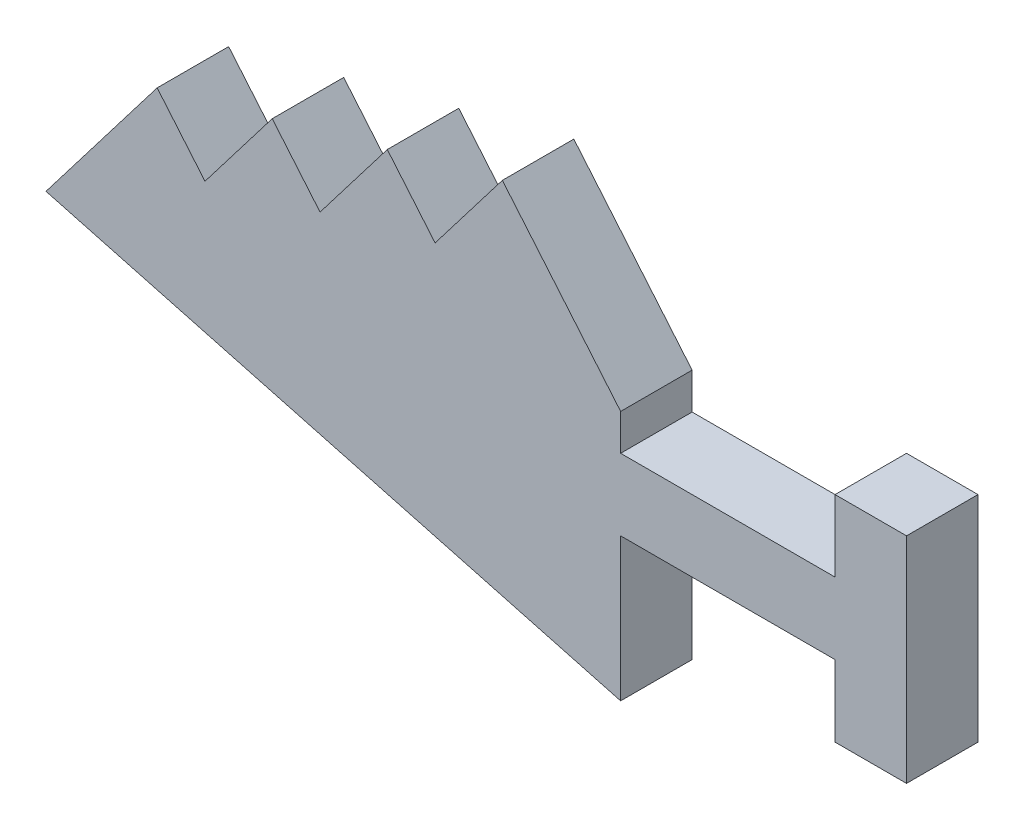
ISO-10303-21;
HEADER;
FILE_DESCRIPTION(('STEP AP214'),'2;1');
FILE_NAME('part.step','',(''),(''),'','','');
FILE_SCHEMA(('AUTOMOTIVE_DESIGN { 1 0 10303 214 1 1 1 1 }'));
ENDSEC;
DATA;
#1=APPLICATION_CONTEXT('core data for automotive mechanical design processes');
#2=APPLICATION_PROTOCOL_DEFINITION('international standard','automotive_design',2000,#1);
#3=PRODUCT_CONTEXT('',#1,'mechanical');
#4=PRODUCT('Part','Part','',(#3));
#5=PRODUCT_RELATED_PRODUCT_CATEGORY('part','',(#4));
#6=PRODUCT_DEFINITION_FORMATION('','',#4);
#7=PRODUCT_DEFINITION_CONTEXT('part definition',#1,'design');
#8=PRODUCT_DEFINITION('design','',#6,#7);
#9=PRODUCT_DEFINITION_SHAPE('','',#8);
#10=(LENGTH_UNIT() NAMED_UNIT(*) SI_UNIT(.MILLI.,.METRE.));
#11=(NAMED_UNIT(*) PLANE_ANGLE_UNIT() SI_UNIT($,.RADIAN.));
#12=(NAMED_UNIT(*) SI_UNIT($,.STERADIAN.) SOLID_ANGLE_UNIT());
#13=UNCERTAINTY_MEASURE_WITH_UNIT(LENGTH_MEASURE(1.E-05),#10,'distance_accuracy_value','');
#14=(GEOMETRIC_REPRESENTATION_CONTEXT(3) GLOBAL_UNCERTAINTY_ASSIGNED_CONTEXT((#13)) GLOBAL_UNIT_ASSIGNED_CONTEXT((#10,
#11,#12)) REPRESENTATION_CONTEXT('',''));
#15=CARTESIAN_POINT('',(0.,0.,0.));
#16=DIRECTION('',(0.,0.,1.));
#17=DIRECTION('',(1.,0.,0.));
#18=AXIS2_PLACEMENT_3D('',#15,#16,#17);
#19=CARTESIAN_POINT('',(66.0319458824785,7.59170549426689,6.));
#20=DIRECTION('',(-0.258819045102532,-0.965925826289065,0.));
#21=DIRECTION('',(0.965925826289065,-0.258819045102532,0.));
#22=AXIS2_PLACEMENT_3D('',#19,#20,#21);
#23=PLANE('',#22);
#24=DIRECTION('',(-0.965925826289065,0.258819045102532,0.));
#25=VECTOR('',#24,1.);
#26=CARTESIAN_POINT('',(66.0319458824785,7.59170549426689,0.));
#27=LINE('',#26,#25);
#28=CARTESIAN_POINT('',(66.0319458824785,7.59170549426689,0.));
#29=VERTEX_POINT('',#28);
#30=CARTESIAN_POINT('',(17.7918774883562,20.5175928632947,0.));
#31=VERTEX_POINT('',#30);
#32=EDGE_CURVE('E198',#29,#31,#27,.T.);
#33=ORIENTED_EDGE('',*,*,#32,.F.);
#34=DIRECTION('',(0.,0.,-1.));
#35=VECTOR('',#34,1.);
#36=CARTESIAN_POINT('',(66.0319458824785,7.59170549426689,6.));
#37=LINE('',#36,#35);
#38=CARTESIAN_POINT('',(66.0319458824785,7.59170549426689,6.));
#39=VERTEX_POINT('',#38);
#40=EDGE_CURVE('E48',#39,#29,#37,.T.);
#41=ORIENTED_EDGE('',*,*,#40,.F.);
#42=DIRECTION('',(-0.965925826289065,0.258819045102532,0.));
#43=VECTOR('',#42,1.);
#44=CARTESIAN_POINT('',(66.0319458824785,7.59170549426689,6.));
#45=LINE('',#44,#43);
#46=CARTESIAN_POINT('',(17.7918774883562,20.5175928632947,6.));
#47=VERTEX_POINT('',#46);
#48=EDGE_CURVE('E320',#39,#47,#45,.T.);
#49=ORIENTED_EDGE('',*,*,#48,.T.);
#50=DIRECTION('',(0.,0.,-1.));
#51=VECTOR('',#50,1.);
#52=CARTESIAN_POINT('',(17.7918774883562,20.5175928632947,6.));
#53=LINE('',#52,#51);
#54=EDGE_CURVE('E11',#47,#31,#53,.T.);
#55=ORIENTED_EDGE('',*,*,#54,.T.);
#56=EDGE_LOOP('',(#33,#41,#49,#55));
#57=FACE_BOUND('',#56,.T.);
#58=ADVANCED_FACE('F39',(#57),#23,.T.);
#59=CARTESIAN_POINT('',(66.0319458824785,7.59170549426689,6.));
#60=DIRECTION('',(-1.,0.,0.));
#61=DIRECTION('',(0.,0.,1.));
#62=AXIS2_PLACEMENT_3D('',#59,#60,#61);
#63=PLANE('',#62);
#64=DIRECTION('',(0.,1.,0.));
#65=VECTOR('',#64,1.);
#66=CARTESIAN_POINT('',(66.0319458824785,7.59170549426689,0.));
#67=LINE('',#66,#65);
#68=CARTESIAN_POINT('',(66.0319458824785,19.5917054942669,0.));
#69=VERTEX_POINT('',#68);
#70=EDGE_CURVE('E202',#29,#69,#67,.T.);
#71=ORIENTED_EDGE('',*,*,#70,.T.);
#72=DIRECTION('',(0.,0.,-1.));
#73=VECTOR('',#72,1.);
#74=CARTESIAN_POINT('',(66.0319458824785,19.5917054942669,6.));
#75=LINE('',#74,#73);
#76=CARTESIAN_POINT('',(66.0319458824785,19.5917054942669,6.));
#77=VERTEX_POINT('',#76);
#78=EDGE_CURVE('E304',#77,#69,#75,.T.);
#79=ORIENTED_EDGE('',*,*,#78,.F.);
#80=DIRECTION('',(0.,1.,0.));
#81=VECTOR('',#80,1.);
#82=CARTESIAN_POINT('',(66.0319458824785,7.59170549426689,6.));
#83=LINE('',#82,#81);
#84=EDGE_CURVE('E313',#39,#77,#83,.T.);
#85=ORIENTED_EDGE('',*,*,#84,.F.);
#86=ORIENTED_EDGE('',*,*,#40,.T.);
#87=EDGE_LOOP('',(#71,#79,#85,#86));
#88=FACE_BOUND('',#87,.T.);
#89=ADVANCED_FACE('F311',(#88),#63,.F.);
#90=CARTESIAN_POINT('',(66.0319458824785,19.5917054942669,6.));
#91=DIRECTION('',(0.,1.,0.));
#92=DIRECTION('',(0.,0.,1.));
#93=AXIS2_PLACEMENT_3D('',#90,#91,#92);
#94=PLANE('',#93);
#95=DIRECTION('',(1.,0.,0.));
#96=VECTOR('',#95,1.);
#97=CARTESIAN_POINT('',(66.0319458824785,19.5917054942669,0.));
#98=LINE('',#97,#96);
#99=CARTESIAN_POINT('',(84.0319458824785,19.5917054942669,0.));
#100=VERTEX_POINT('',#99);
#101=EDGE_CURVE('E205',#69,#100,#98,.T.);
#102=ORIENTED_EDGE('',*,*,#101,.T.);
#103=DIRECTION('',(0.,0.,-1.));
#104=VECTOR('',#103,1.);
#105=CARTESIAN_POINT('',(84.0319458824785,19.5917054942669,6.));
#106=LINE('',#105,#104);
#107=CARTESIAN_POINT('',(84.0319458824785,19.5917054942669,6.));
#108=VERTEX_POINT('',#107);
#109=EDGE_CURVE('E301',#108,#100,#106,.T.);
#110=ORIENTED_EDGE('',*,*,#109,.F.);
#111=DIRECTION('',(1.,0.,0.));
#112=VECTOR('',#111,1.);
#113=CARTESIAN_POINT('',(66.0319458824785,19.5917054942669,6.));
#114=LINE('',#113,#112);
#115=EDGE_CURVE('E547',#77,#108,#114,.T.);
#116=ORIENTED_EDGE('',*,*,#115,.F.);
#117=ORIENTED_EDGE('',*,*,#78,.T.);
#118=EDGE_LOOP('',(#102,#110,#116,#117));
#119=FACE_BOUND('',#118,.T.);
#120=ADVANCED_FACE('F335',(#119),#94,.F.);
#121=CARTESIAN_POINT('',(84.0319458824785,13.5917054942669,6.));
#122=DIRECTION('',(-1.,0.,0.));
#123=DIRECTION('',(0.,0.,1.));
#124=AXIS2_PLACEMENT_3D('',#121,#122,#123);
#125=PLANE('',#124);
#126=DIRECTION('',(0.,1.,0.));
#127=VECTOR('',#126,1.);
#128=CARTESIAN_POINT('',(84.0319458824785,13.5917054942669,0.));
#129=LINE('',#128,#127);
#130=CARTESIAN_POINT('',(84.0319458824785,13.5917054942669,0.));
#131=VERTEX_POINT('',#130);
#132=EDGE_CURVE('E209',#131,#100,#129,.T.);
#133=ORIENTED_EDGE('',*,*,#132,.F.);
#134=DIRECTION('',(0.,0.,-1.));
#135=VECTOR('',#134,1.);
#136=CARTESIAN_POINT('',(84.0319458824785,13.5917054942669,6.));
#137=LINE('',#136,#135);
#138=CARTESIAN_POINT('',(84.0319458824785,13.5917054942669,6.));
#139=VERTEX_POINT('',#138);
#140=EDGE_CURVE('E298',#139,#131,#137,.T.);
#141=ORIENTED_EDGE('',*,*,#140,.F.);
#142=DIRECTION('',(0.,1.,0.));
#143=VECTOR('',#142,1.);
#144=CARTESIAN_POINT('',(84.0319458824785,13.5917054942669,6.));
#145=LINE('',#144,#143);
#146=EDGE_CURVE('E545',#139,#108,#145,.T.);
#147=ORIENTED_EDGE('',*,*,#146,.T.);
#148=ORIENTED_EDGE('',*,*,#109,.T.);
#149=EDGE_LOOP('',(#133,#141,#147,#148));
#150=FACE_BOUND('',#149,.T.);
#151=ADVANCED_FACE('F339',(#150),#125,.T.);
#152=CARTESIAN_POINT('',(90.0319458824785,13.5917054942669,6.));
#153=DIRECTION('',(0.,-1.,0.));
#154=DIRECTION('',(0.,0.,-1.));
#155=AXIS2_PLACEMENT_3D('',#152,#153,#154);
#156=PLANE('',#155);
#157=DIRECTION('',(-1.,0.,0.));
#158=VECTOR('',#157,1.);
#159=CARTESIAN_POINT('',(90.0319458824785,13.5917054942669,0.));
#160=LINE('',#159,#158);
#161=CARTESIAN_POINT('',(90.0319458824785,13.5917054942669,0.));
#162=VERTEX_POINT('',#161);
#163=EDGE_CURVE('E213',#162,#131,#160,.T.);
#164=ORIENTED_EDGE('',*,*,#163,.F.);
#165=DIRECTION('',(0.,0.,-1.));
#166=VECTOR('',#165,1.);
#167=CARTESIAN_POINT('',(90.0319458824785,13.5917054942669,6.));
#168=LINE('',#167,#166);
#169=CARTESIAN_POINT('',(90.0319458824785,13.5917054942669,6.));
#170=VERTEX_POINT('',#169);
#171=EDGE_CURVE('E295',#170,#162,#168,.T.);
#172=ORIENTED_EDGE('',*,*,#171,.F.);
#173=DIRECTION('',(-1.,0.,0.));
#174=VECTOR('',#173,1.);
#175=CARTESIAN_POINT('',(90.0319458824785,13.5917054942669,6.));
#176=LINE('',#175,#174);
#177=EDGE_CURVE('E552',#170,#139,#176,.T.);
#178=ORIENTED_EDGE('',*,*,#177,.T.);
#179=ORIENTED_EDGE('',*,*,#140,.T.);
#180=EDGE_LOOP('',(#164,#172,#178,#179));
#181=FACE_BOUND('',#180,.T.);
#182=ADVANCED_FACE('F345',(#181),#156,.T.);
#183=CARTESIAN_POINT('',(90.0319458824785,31.5917054942669,6.));
#184=DIRECTION('',(1.,0.,0.));
#185=DIRECTION('',(0.,0.,-1.));
#186=AXIS2_PLACEMENT_3D('',#183,#184,#185);
#187=PLANE('',#186);
#188=DIRECTION('',(0.,-1.,0.));
#189=VECTOR('',#188,1.);
#190=CARTESIAN_POINT('',(90.0319458824785,31.5917054942669,0.));
#191=LINE('',#190,#189);
#192=CARTESIAN_POINT('',(90.0319458824785,31.5917054942669,0.));
#193=VERTEX_POINT('',#192);
#194=EDGE_CURVE('E217',#193,#162,#191,.T.);
#195=ORIENTED_EDGE('',*,*,#194,.F.);
#196=DIRECTION('',(0.,0.,-1.));
#197=VECTOR('',#196,1.);
#198=CARTESIAN_POINT('',(90.0319458824785,31.5917054942669,6.));
#199=LINE('',#198,#197);
#200=CARTESIAN_POINT('',(90.0319458824785,31.5917054942669,6.));
#201=VERTEX_POINT('',#200);
#202=EDGE_CURVE('E292',#201,#193,#199,.T.);
#203=ORIENTED_EDGE('',*,*,#202,.F.);
#204=DIRECTION('',(0.,-1.,0.));
#205=VECTOR('',#204,1.);
#206=CARTESIAN_POINT('',(90.0319458824785,31.5917054942669,6.));
#207=LINE('',#206,#205);
#208=EDGE_CURVE('E538',#201,#170,#207,.T.);
#209=ORIENTED_EDGE('',*,*,#208,.T.);
#210=ORIENTED_EDGE('',*,*,#171,.T.);
#211=EDGE_LOOP('',(#195,#203,#209,#210));
#212=FACE_BOUND('',#211,.T.);
#213=ADVANCED_FACE('F349',(#212),#187,.T.);
#214=CARTESIAN_POINT('',(90.0319458824785,31.5917054942669,6.));
#215=DIRECTION('',(0.,-1.,0.));
#216=DIRECTION('',(0.,0.,-1.));
#217=AXIS2_PLACEMENT_3D('',#214,#215,#216);
#218=PLANE('',#217);
#219=DIRECTION('',(-1.,0.,0.));
#220=VECTOR('',#219,1.);
#221=CARTESIAN_POINT('',(90.0319458824785,31.5917054942669,0.));
#222=LINE('',#221,#220);
#223=CARTESIAN_POINT('',(84.0319458824785,31.5917054942669,0.));
#224=VERTEX_POINT('',#223);
#225=EDGE_CURVE('E221',#193,#224,#222,.T.);
#226=ORIENTED_EDGE('',*,*,#225,.T.);
#227=DIRECTION('',(0.,0.,-1.));
#228=VECTOR('',#227,1.);
#229=CARTESIAN_POINT('',(84.0319458824785,31.5917054942669,6.));
#230=LINE('',#229,#228);
#231=CARTESIAN_POINT('',(84.0319458824785,31.5917054942669,6.));
#232=VERTEX_POINT('',#231);
#233=EDGE_CURVE('E288',#232,#224,#230,.T.);
#234=ORIENTED_EDGE('',*,*,#233,.F.);
#235=DIRECTION('',(-1.,0.,0.));
#236=VECTOR('',#235,1.);
#237=CARTESIAN_POINT('',(90.0319458824785,31.5917054942669,6.));
#238=LINE('',#237,#236);
#239=EDGE_CURVE('E561',#201,#232,#238,.T.);
#240=ORIENTED_EDGE('',*,*,#239,.F.);
#241=ORIENTED_EDGE('',*,*,#202,.T.);
#242=EDGE_LOOP('',(#226,#234,#240,#241));
#243=FACE_BOUND('',#242,.T.);
#244=ADVANCED_FACE('F353',(#243),#218,.F.);
#245=CARTESIAN_POINT('',(84.0319458824785,31.5917054942669,6.));
#246=DIRECTION('',(1.,0.,0.));
#247=DIRECTION('',(0.,0.,-1.));
#248=AXIS2_PLACEMENT_3D('',#245,#246,#247);
#249=PLANE('',#248);
#250=DIRECTION('',(0.,-1.,0.));
#251=VECTOR('',#250,1.);
#252=CARTESIAN_POINT('',(84.0319458824785,31.5917054942669,0.));
#253=LINE('',#252,#251);
#254=CARTESIAN_POINT('',(84.0319458824785,25.5917054942669,0.));
#255=VERTEX_POINT('',#254);
#256=EDGE_CURVE('E224',#224,#255,#253,.T.);
#257=ORIENTED_EDGE('',*,*,#256,.T.);
#258=DIRECTION('',(0.,0.,-1.));
#259=VECTOR('',#258,1.);
#260=CARTESIAN_POINT('',(84.0319458824785,25.5917054942669,6.));
#261=LINE('',#260,#259);
#262=CARTESIAN_POINT('',(84.0319458824785,25.5917054942669,6.));
#263=VERTEX_POINT('',#262);
#264=EDGE_CURVE('E284',#263,#255,#261,.T.);
#265=ORIENTED_EDGE('',*,*,#264,.F.);
#266=DIRECTION('',(0.,-1.,0.));
#267=VECTOR('',#266,1.);
#268=CARTESIAN_POINT('',(84.0319458824785,31.5917054942669,6.));
#269=LINE('',#268,#267);
#270=EDGE_CURVE('E530',#232,#263,#269,.T.);
#271=ORIENTED_EDGE('',*,*,#270,.F.);
#272=ORIENTED_EDGE('',*,*,#233,.T.);
#273=EDGE_LOOP('',(#257,#265,#271,#272));
#274=FACE_BOUND('',#273,.T.);
#275=ADVANCED_FACE('F357',(#274),#249,.F.);
#276=CARTESIAN_POINT('',(84.0319458824785,25.5917054942669,6.));
#277=DIRECTION('',(0.,-1.,0.));
#278=DIRECTION('',(0.,0.,-1.));
#279=AXIS2_PLACEMENT_3D('',#276,#277,#278);
#280=PLANE('',#279);
#281=DIRECTION('',(-1.,0.,0.));
#282=VECTOR('',#281,1.);
#283=CARTESIAN_POINT('',(84.0319458824785,25.5917054942669,0.));
#284=LINE('',#283,#282);
#285=CARTESIAN_POINT('',(66.0319458824794,25.5917054942669,0.));
#286=VERTEX_POINT('',#285);
#287=EDGE_CURVE('E227',#255,#286,#284,.T.);
#288=ORIENTED_EDGE('',*,*,#287,.T.);
#289=DIRECTION('',(0.,0.,-1.));
#290=VECTOR('',#289,1.);
#291=CARTESIAN_POINT('',(66.0319458824794,25.5917054942669,6.));
#292=LINE('',#291,#290);
#293=CARTESIAN_POINT('',(66.0319458824794,25.5917054942669,6.));
#294=VERTEX_POINT('',#293);
#295=EDGE_CURVE('E281',#294,#286,#292,.T.);
#296=ORIENTED_EDGE('',*,*,#295,.F.);
#297=DIRECTION('',(-1.,0.,0.));
#298=VECTOR('',#297,1.);
#299=CARTESIAN_POINT('',(84.0319458824785,25.5917054942669,6.));
#300=LINE('',#299,#298);
#301=EDGE_CURVE('E528',#263,#294,#300,.T.);
#302=ORIENTED_EDGE('',*,*,#301,.F.);
#303=ORIENTED_EDGE('',*,*,#264,.T.);
#304=EDGE_LOOP('',(#288,#296,#302,#303));
#305=FACE_BOUND('',#304,.T.);
#306=ADVANCED_FACE('F361',(#305),#280,.F.);
#307=CARTESIAN_POINT('',(66.0319458824785,28.6369343508799,6.));
#308=DIRECTION('',(1.,2.96219512549621E-13,0.));
#309=DIRECTION('',(-2.96219512549621E-13,1.,0.));
#310=AXIS2_PLACEMENT_3D('',#307,#308,#309);
#311=PLANE('',#310);
#312=DIRECTION('',(2.96219512549621E-13,-1.,0.));
#313=VECTOR('',#312,1.);
#314=CARTESIAN_POINT('',(66.0319458824785,28.6369343508799,0.));
#315=LINE('',#314,#313);
#316=CARTESIAN_POINT('',(66.0319458824785,28.6369343508799,0.));
#317=VERTEX_POINT('',#316);
#318=EDGE_CURVE('E231',#317,#286,#315,.T.);
#319=ORIENTED_EDGE('',*,*,#318,.F.);
#320=DIRECTION('',(0.,0.,-1.));
#321=VECTOR('',#320,1.);
#322=CARTESIAN_POINT('',(66.0319458824785,28.6369343508799,6.));
#323=LINE('',#322,#321);
#324=CARTESIAN_POINT('',(66.0319458824785,28.6369343508799,6.));
#325=VERTEX_POINT('',#324);
#326=EDGE_CURVE('E278',#325,#317,#323,.T.);
#327=ORIENTED_EDGE('',*,*,#326,.F.);
#328=DIRECTION('',(2.96219512549621E-13,-1.,0.));
#329=VECTOR('',#328,1.);
#330=CARTESIAN_POINT('',(66.0319458824785,28.6369343508799,6.));
#331=LINE('',#330,#329);
#332=EDGE_CURVE('E525',#325,#294,#331,.T.);
#333=ORIENTED_EDGE('',*,*,#332,.T.);
#334=ORIENTED_EDGE('',*,*,#295,.T.);
#335=EDGE_LOOP('',(#319,#327,#333,#334));
#336=FACE_BOUND('',#335,.T.);
#337=ADVANCED_FACE('F365',(#336),#311,.T.);
#338=CARTESIAN_POINT('',(56.1018161365525,40.471202150516,6.));
#339=DIRECTION('',(0.766044443119035,0.642787609686471,0.));
#340=DIRECTION('',(-0.642787609686471,0.766044443119035,0.));
#341=AXIS2_PLACEMENT_3D('',#338,#339,#340);
#342=PLANE('',#341);
#343=DIRECTION('',(0.642787609686471,-0.766044443119035,0.));
#344=VECTOR('',#343,1.);
#345=CARTESIAN_POINT('',(56.1018161365525,40.471202150516,0.));
#346=LINE('',#345,#344);
#347=CARTESIAN_POINT('',(56.1018161365525,40.471202150516,0.));
#348=VERTEX_POINT('',#347);
#349=EDGE_CURVE('E235',#348,#317,#346,.T.);
#350=ORIENTED_EDGE('',*,*,#349,.F.);
#351=DIRECTION('',(0.,0.,-1.));
#352=VECTOR('',#351,1.);
#353=CARTESIAN_POINT('',(56.1018161365525,40.471202150516,6.));
#354=LINE('',#353,#352);
#355=CARTESIAN_POINT('',(56.1018161365525,40.471202150516,6.));
#356=VERTEX_POINT('',#355);
#357=EDGE_CURVE('E275',#356,#348,#354,.T.);
#358=ORIENTED_EDGE('',*,*,#357,.F.);
#359=DIRECTION('',(0.642787609686471,-0.766044443119035,0.));
#360=VECTOR('',#359,1.);
#361=CARTESIAN_POINT('',(56.1018161365525,40.471202150516,6.));
#362=LINE('',#361,#360);
#363=EDGE_CURVE('E570',#356,#325,#362,.T.);
#364=ORIENTED_EDGE('',*,*,#363,.T.);
#365=ORIENTED_EDGE('',*,*,#326,.T.);
#366=EDGE_LOOP('',(#350,#358,#364,#365));
#367=FACE_BOUND('',#366,.T.);
#368=ADVANCED_FACE('F369',(#367),#342,.T.);
#369=CARTESIAN_POINT('',(50.4571836617066,33.0985669936657,6.));
#370=DIRECTION('',(-0.794007702370693,0.607907697414675,0.));
#371=DIRECTION('',(-0.607907697414675,-0.794007702370693,0.));
#372=AXIS2_PLACEMENT_3D('',#369,#370,#371);
#373=PLANE('',#372);
#374=DIRECTION('',(0.607907697414675,0.794007702370693,0.));
#375=VECTOR('',#374,1.);
#376=CARTESIAN_POINT('',(50.4571836617066,33.0985669936657,0.));
#377=LINE('',#376,#375);
#378=CARTESIAN_POINT('',(50.4571836617066,33.0985669936657,0.));
#379=VERTEX_POINT('',#378);
#380=EDGE_CURVE('E239',#379,#348,#377,.T.);
#381=ORIENTED_EDGE('',*,*,#380,.F.);
#382=DIRECTION('',(0.,0.,-1.));
#383=VECTOR('',#382,1.);
#384=CARTESIAN_POINT('',(50.4571836617066,33.0985669936657,6.));
#385=LINE('',#384,#383);
#386=CARTESIAN_POINT('',(50.4571836617066,33.0985669936657,6.));
#387=VERTEX_POINT('',#386);
#388=EDGE_CURVE('E272',#387,#379,#385,.T.);
#389=ORIENTED_EDGE('',*,*,#388,.F.);
#390=DIRECTION('',(0.607907697414675,0.794007702370693,0.));
#391=VECTOR('',#390,1.);
#392=CARTESIAN_POINT('',(50.4571836617066,33.0985669936657,6.));
#393=LINE('',#392,#391);
#394=EDGE_CURVE('E516',#387,#356,#393,.T.);
#395=ORIENTED_EDGE('',*,*,#394,.T.);
#396=ORIENTED_EDGE('',*,*,#357,.T.);
#397=EDGE_LOOP('',(#381,#389,#395,#396));
#398=FACE_BOUND('',#397,.T.);
#399=ADVANCED_FACE('F373',(#398),#373,.T.);
#400=CARTESIAN_POINT('',(50.4571836617066,33.0985669936657,6.));
#401=DIRECTION('',(-0.76604444311904,-0.642787609686465,0.));
#402=DIRECTION('',(0.642787609686465,-0.766044443119041,0.));
#403=AXIS2_PLACEMENT_3D('',#400,#401,#402);
#404=PLANE('',#403);
#405=DIRECTION('',(-0.642787609686465,0.76604444311904,0.));
#406=VECTOR('',#405,1.);
#407=CARTESIAN_POINT('',(50.4571836617066,33.0985669936657,0.));
#408=LINE('',#407,#406);
#409=CARTESIAN_POINT('',(46.4425578736615,37.8830116994908,0.));
#410=VERTEX_POINT('',#409);
#411=EDGE_CURVE('E243',#379,#410,#408,.T.);
#412=ORIENTED_EDGE('',*,*,#411,.T.);
#413=DIRECTION('',(0.,0.,-1.));
#414=VECTOR('',#413,1.);
#415=CARTESIAN_POINT('',(46.4425578736615,37.8830116994908,6.));
#416=LINE('',#415,#414);
#417=CARTESIAN_POINT('',(46.4425578736615,37.8830116994908,6.));
#418=VERTEX_POINT('',#417);
#419=EDGE_CURVE('E269',#418,#410,#416,.T.);
#420=ORIENTED_EDGE('',*,*,#419,.F.);
#421=DIRECTION('',(-0.642787609686465,0.76604444311904,0.));
#422=VECTOR('',#421,1.);
#423=CARTESIAN_POINT('',(50.4571836617066,33.0985669936657,6.));
#424=LINE('',#423,#422);
#425=EDGE_CURVE('E575',#387,#418,#424,.T.);
#426=ORIENTED_EDGE('',*,*,#425,.F.);
#427=ORIENTED_EDGE('',*,*,#388,.T.);
#428=EDGE_LOOP('',(#412,#420,#426,#427));
#429=FACE_BOUND('',#428,.T.);
#430=ADVANCED_FACE('F377',(#429),#404,.F.);
#431=CARTESIAN_POINT('',(40.7979253988157,30.5103765426405,6.));
#432=DIRECTION('',(-0.794007702370693,0.607907697414675,0.));
#433=DIRECTION('',(-0.607907697414675,-0.794007702370693,0.));
#434=AXIS2_PLACEMENT_3D('',#431,#432,#433);
#435=PLANE('',#434);
#436=DIRECTION('',(0.607907697414675,0.794007702370693,0.));
#437=VECTOR('',#436,1.);
#438=CARTESIAN_POINT('',(40.7979253988157,30.5103765426405,0.));
#439=LINE('',#438,#437);
#440=CARTESIAN_POINT('',(40.7979253988157,30.5103765426405,0.));
#441=VERTEX_POINT('',#440);
#442=EDGE_CURVE('E247',#441,#410,#439,.T.);
#443=ORIENTED_EDGE('',*,*,#442,.F.);
#444=DIRECTION('',(0.,0.,-1.));
#445=VECTOR('',#444,1.);
#446=CARTESIAN_POINT('',(40.7979253988157,30.5103765426405,6.));
#447=LINE('',#446,#445);
#448=CARTESIAN_POINT('',(40.7979253988157,30.5103765426405,6.));
#449=VERTEX_POINT('',#448);
#450=EDGE_CURVE('E188',#449,#441,#447,.T.);
#451=ORIENTED_EDGE('',*,*,#450,.F.);
#452=DIRECTION('',(0.607907697414675,0.794007702370693,0.));
#453=VECTOR('',#452,1.);
#454=CARTESIAN_POINT('',(40.7979253988157,30.5103765426405,6.));
#455=LINE('',#454,#453);
#456=EDGE_CURVE('E175',#449,#418,#455,.T.);
#457=ORIENTED_EDGE('',*,*,#456,.T.);
#458=ORIENTED_EDGE('',*,*,#419,.T.);
#459=EDGE_LOOP('',(#443,#451,#457,#458));
#460=FACE_BOUND('',#459,.T.);
#461=ADVANCED_FACE('F381',(#460),#435,.T.);
#462=CARTESIAN_POINT('',(40.7979253988157,30.5103765426405,6.));
#463=DIRECTION('',(-0.766044443119041,-0.642787609686465,0.));
#464=DIRECTION('',(0.642787609686465,-0.766044443119041,0.));
#465=AXIS2_PLACEMENT_3D('',#462,#463,#464);
#466=PLANE('',#465);
#467=DIRECTION('',(-0.642787609686465,0.766044443119041,0.));
#468=VECTOR('',#467,1.);
#469=CARTESIAN_POINT('',(40.7979253988157,30.5103765426405,0.));
#470=LINE('',#469,#468);
#471=CARTESIAN_POINT('',(36.7832996107706,35.2948212484656,0.));
#472=VERTEX_POINT('',#471);
#473=EDGE_CURVE('E183',#441,#472,#470,.T.);
#474=ORIENTED_EDGE('',*,*,#473,.T.);
#475=DIRECTION('',(0.,0.,-1.));
#476=VECTOR('',#475,1.);
#477=CARTESIAN_POINT('',(36.7832996107706,35.2948212484656,6.));
#478=LINE('',#477,#476);
#479=CARTESIAN_POINT('',(36.7832996107706,35.2948212484656,6.));
#480=VERTEX_POINT('',#479);
#481=EDGE_CURVE('E180',#480,#472,#478,.T.);
#482=ORIENTED_EDGE('',*,*,#481,.F.);
#483=DIRECTION('',(-0.642787609686465,0.766044443119041,0.));
#484=VECTOR('',#483,1.);
#485=CARTESIAN_POINT('',(40.7979253988157,30.5103765426405,6.));
#486=LINE('',#485,#484);
#487=EDGE_CURVE('E169',#449,#480,#486,.T.);
#488=ORIENTED_EDGE('',*,*,#487,.F.);
#489=ORIENTED_EDGE('',*,*,#450,.T.);
#490=EDGE_LOOP('',(#474,#482,#488,#489));
#491=FACE_BOUND('',#490,.T.);
#492=ADVANCED_FACE('F181',(#491),#466,.F.);
#493=CARTESIAN_POINT('',(31.1386671359247,27.9221860916154,6.));
#494=DIRECTION('',(-0.794007702370693,0.607907697414676,0.));
#495=DIRECTION('',(-0.607907697414676,-0.794007702370693,0.));
#496=AXIS2_PLACEMENT_3D('',#493,#494,#495);
#497=PLANE('',#496);
#498=DIRECTION('',(0.607907697414676,0.794007702370693,0.));
#499=VECTOR('',#498,1.);
#500=CARTESIAN_POINT('',(31.1386671359247,27.9221860916154,0.));
#501=LINE('',#500,#499);
#502=CARTESIAN_POINT('',(31.1386671359247,27.9221860916154,0.));
#503=VERTEX_POINT('',#502);
#504=EDGE_CURVE('E253',#503,#472,#501,.T.);
#505=ORIENTED_EDGE('',*,*,#504,.F.);
#506=DIRECTION('',(0.,0.,-1.));
#507=VECTOR('',#506,1.);
#508=CARTESIAN_POINT('',(31.1386671359247,27.9221860916154,6.));
#509=LINE('',#508,#507);
#510=CARTESIAN_POINT('',(31.1386671359247,27.9221860916154,6.));
#511=VERTEX_POINT('',#510);
#512=EDGE_CURVE('E115',#511,#503,#509,.T.);
#513=ORIENTED_EDGE('',*,*,#512,.F.);
#514=DIRECTION('',(0.607907697414676,0.794007702370693,0.));
#515=VECTOR('',#514,1.);
#516=CARTESIAN_POINT('',(31.1386671359247,27.9221860916154,6.));
#517=LINE('',#516,#515);
#518=EDGE_CURVE('E173',#511,#480,#517,.T.);
#519=ORIENTED_EDGE('',*,*,#518,.T.);
#520=ORIENTED_EDGE('',*,*,#481,.T.);
#521=EDGE_LOOP('',(#505,#513,#519,#520));
#522=FACE_BOUND('',#521,.T.);
#523=ADVANCED_FACE('F190',(#522),#497,.T.);
#524=CARTESIAN_POINT('',(31.1386671359247,27.9221860916154,6.));
#525=DIRECTION('',(-0.76604444311904,-0.642787609686465,0.));
#526=DIRECTION('',(0.642787609686465,-0.766044443119041,0.));
#527=AXIS2_PLACEMENT_3D('',#524,#525,#526);
#528=PLANE('',#527);
#529=DIRECTION('',(-0.642787609686465,0.766044443119041,0.));
#530=VECTOR('',#529,1.);
#531=CARTESIAN_POINT('',(31.1386671359247,27.9221860916154,0.));
#532=LINE('',#531,#530);
#533=CARTESIAN_POINT('',(27.1240413478796,32.7066307974404,0.));
#534=VERTEX_POINT('',#533);
#535=EDGE_CURVE('E256',#503,#534,#532,.T.);
#536=ORIENTED_EDGE('',*,*,#535,.T.);
#537=DIRECTION('',(0.,0.,-1.));
#538=VECTOR('',#537,1.);
#539=CARTESIAN_POINT('',(27.1240413478796,32.7066307974404,6.));
#540=LINE('',#539,#538);
#541=CARTESIAN_POINT('',(27.1240413478796,32.7066307974404,6.));
#542=VERTEX_POINT('',#541);
#543=EDGE_CURVE('E119',#542,#534,#540,.T.);
#544=ORIENTED_EDGE('',*,*,#543,.F.);
#545=DIRECTION('',(-0.642787609686465,0.766044443119041,0.));
#546=VECTOR('',#545,1.);
#547=CARTESIAN_POINT('',(31.1386671359247,27.9221860916154,6.));
#548=LINE('',#547,#546);
#549=EDGE_CURVE('E192',#511,#542,#548,.T.);
#550=ORIENTED_EDGE('',*,*,#549,.F.);
#551=ORIENTED_EDGE('',*,*,#512,.T.);
#552=EDGE_LOOP('',(#536,#544,#550,#551));
#553=FACE_BOUND('',#552,.T.);
#554=ADVANCED_FACE('F322',(#553),#528,.F.);
#555=CARTESIAN_POINT('',(19.1978706719089,22.3540055653697,6.));
#556=DIRECTION('',(-0.794007702370679,0.607907697414694,0.));
#557=DIRECTION('',(-0.607907697414694,-0.794007702370679,0.));
#558=AXIS2_PLACEMENT_3D('',#555,#556,#557);
#559=PLANE('',#558);
#560=DIRECTION('',(0.607907697414694,0.794007702370679,0.));
#561=VECTOR('',#560,1.);
#562=CARTESIAN_POINT('',(19.1978706719089,22.3540055653697,0.));
#563=LINE('',#562,#561);
#564=EDGE_CURVE('E259',#31,#534,#563,.T.);
#565=ORIENTED_EDGE('',*,*,#564,.F.);
#566=ORIENTED_EDGE('',*,*,#54,.F.);
#567=DIRECTION('',(-0.607907697414699,-0.794007702370675,0.));
#568=VECTOR('',#567,1.);
#569=CARTESIAN_POINT('',(19.1978706719089,22.3540055653697,6.));
#570=LINE('',#569,#568);
#571=EDGE_CURVE('E56',#542,#47,#570,.T.);
#572=ORIENTED_EDGE('',*,*,#571,.F.);
#573=ORIENTED_EDGE('',*,*,#543,.T.);
#574=EDGE_LOOP('',(#565,#566,#572,#573));
#575=FACE_BOUND('',#574,.T.);
#576=ADVANCED_FACE('F321',(#575),#559,.T.);
#577=CARTESIAN_POINT('',(0.,0.,6.));
#578=DIRECTION('',(0.,0.,1.));
#579=DIRECTION('',(1.,0.,0.));
#580=AXIS2_PLACEMENT_3D('',#577,#578,#579);
#581=PLANE('',#580);
#582=ORIENTED_EDGE('',*,*,#571,.T.);
#583=ORIENTED_EDGE('',*,*,#48,.F.);
#584=ORIENTED_EDGE('',*,*,#84,.T.);
#585=ORIENTED_EDGE('',*,*,#115,.T.);
#586=ORIENTED_EDGE('',*,*,#146,.F.);
#587=ORIENTED_EDGE('',*,*,#177,.F.);
#588=ORIENTED_EDGE('',*,*,#208,.F.);
#589=ORIENTED_EDGE('',*,*,#239,.T.);
#590=ORIENTED_EDGE('',*,*,#270,.T.);
#591=ORIENTED_EDGE('',*,*,#301,.T.);
#592=ORIENTED_EDGE('',*,*,#332,.F.);
#593=ORIENTED_EDGE('',*,*,#363,.F.);
#594=ORIENTED_EDGE('',*,*,#394,.F.);
#595=ORIENTED_EDGE('',*,*,#425,.T.);
#596=ORIENTED_EDGE('',*,*,#456,.F.);
#597=ORIENTED_EDGE('',*,*,#487,.T.);
#598=ORIENTED_EDGE('',*,*,#518,.F.);
#599=ORIENTED_EDGE('',*,*,#549,.T.);
#600=EDGE_LOOP('',(#582,#583,#584,#585,#586,#587,#588,#589,#590,#591,#592,#593,#594,#595,#596,
#597,#598,#599));
#601=FACE_BOUND('',#600,.T.);
#602=ADVANCED_FACE('F171',(#601),#581,.T.);
#603=CARTESIAN_POINT('',(0.,0.,0.));
#604=DIRECTION('',(0.,0.,1.));
#605=DIRECTION('',(1.,0.,0.));
#606=AXIS2_PLACEMENT_3D('',#603,#604,#605);
#607=PLANE('',#606);
#608=ORIENTED_EDGE('',*,*,#32,.T.);
#609=ORIENTED_EDGE('',*,*,#564,.T.);
#610=ORIENTED_EDGE('',*,*,#535,.F.);
#611=ORIENTED_EDGE('',*,*,#504,.T.);
#612=ORIENTED_EDGE('',*,*,#473,.F.);
#613=ORIENTED_EDGE('',*,*,#442,.T.);
#614=ORIENTED_EDGE('',*,*,#411,.F.);
#615=ORIENTED_EDGE('',*,*,#380,.T.);
#616=ORIENTED_EDGE('',*,*,#349,.T.);
#617=ORIENTED_EDGE('',*,*,#318,.T.);
#618=ORIENTED_EDGE('',*,*,#287,.F.);
#619=ORIENTED_EDGE('',*,*,#256,.F.);
#620=ORIENTED_EDGE('',*,*,#225,.F.);
#621=ORIENTED_EDGE('',*,*,#194,.T.);
#622=ORIENTED_EDGE('',*,*,#163,.T.);
#623=ORIENTED_EDGE('',*,*,#132,.T.);
#624=ORIENTED_EDGE('',*,*,#101,.F.);
#625=ORIENTED_EDGE('',*,*,#70,.F.);
#626=EDGE_LOOP('',(#608,#609,#610,#611,#612,#613,#614,#615,#616,#617,#618,#619,#620,#621,#622,
#623,#624,#625));
#627=FACE_BOUND('',#626,.T.);
#628=ADVANCED_FACE('F319',(#627),#607,.F.);
#629=CLOSED_SHELL('',(#58,#89,#120,#151,#182,#213,#244,#275,#306,#337,#368,#399,#430,#461,#492,
#523,#554,#576,#602,#628));
#630=MANIFOLD_SOLID_BREP('B2',#629);
#631=ADVANCED_BREP_SHAPE_REPRESENTATION('',(#18,#630),#14);
#632=SHAPE_DEFINITION_REPRESENTATION(#9,#631);
ENDSEC;
END-ISO-10303-21;
